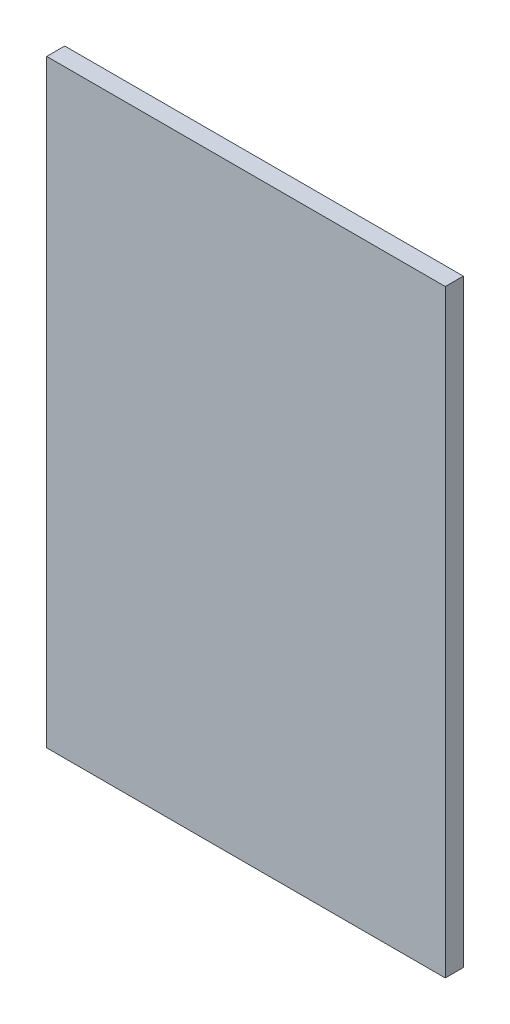
ISO-10303-21;
HEADER;
FILE_DESCRIPTION(('STEP AP214'),'2;1');
FILE_NAME('part.step','',(''),(''),'','','');
FILE_SCHEMA(('AUTOMOTIVE_DESIGN { 1 0 10303 214 1 1 1 1 }'));
ENDSEC;
DATA;
#1=APPLICATION_CONTEXT('core data for automotive mechanical design processes');
#2=APPLICATION_PROTOCOL_DEFINITION('international standard','automotive_design',2000,#1);
#3=PRODUCT_CONTEXT('',#1,'mechanical');
#4=PRODUCT('Part','Part','',(#3));
#5=PRODUCT_RELATED_PRODUCT_CATEGORY('part','',(#4));
#6=PRODUCT_DEFINITION_FORMATION('','',#4);
#7=PRODUCT_DEFINITION_CONTEXT('part definition',#1,'design');
#8=PRODUCT_DEFINITION('design','',#6,#7);
#9=PRODUCT_DEFINITION_SHAPE('','',#8);
#10=(LENGTH_UNIT() NAMED_UNIT(*) SI_UNIT(.MILLI.,.METRE.));
#11=(NAMED_UNIT(*) PLANE_ANGLE_UNIT() SI_UNIT($,.RADIAN.));
#12=(NAMED_UNIT(*) SI_UNIT($,.STERADIAN.) SOLID_ANGLE_UNIT());
#13=UNCERTAINTY_MEASURE_WITH_UNIT(LENGTH_MEASURE(1.E-05),#10,'distance_accuracy_value','');
#14=(GEOMETRIC_REPRESENTATION_CONTEXT(3) GLOBAL_UNCERTAINTY_ASSIGNED_CONTEXT((#13)) GLOBAL_UNIT_ASSIGNED_CONTEXT((#10,
#11,#12)) REPRESENTATION_CONTEXT('',''));
#15=CARTESIAN_POINT('',(0.,0.,0.));
#16=DIRECTION('',(0.,0.,1.));
#17=DIRECTION('',(1.,0.,0.));
#18=AXIS2_PLACEMENT_3D('',#15,#16,#17);
#19=CARTESIAN_POINT('',(-199.,-299.,18.));
#20=DIRECTION('',(1.,0.,0.));
#21=DIRECTION('',(0.,0.,-1.));
#22=AXIS2_PLACEMENT_3D('',#19,#20,#21);
#23=PLANE('',#22);
#24=DIRECTION('',(0.,-1.,0.));
#25=VECTOR('',#24,1.);
#26=CARTESIAN_POINT('',(-199.,-299.,0.));
#27=LINE('',#26,#25);
#28=CARTESIAN_POINT('',(-199.,299.,0.));
#29=VERTEX_POINT('',#28);
#30=CARTESIAN_POINT('',(-199.,-299.,0.));
#31=VERTEX_POINT('',#30);
#32=EDGE_CURVE('E95',#29,#31,#27,.T.);
#33=ORIENTED_EDGE('',*,*,#32,.T.);
#34=DIRECTION('',(0.,0.,-1.));
#35=VECTOR('',#34,1.);
#36=CARTESIAN_POINT('',(-199.,-299.,18.));
#37=LINE('',#36,#35);
#38=CARTESIAN_POINT('',(-199.,-299.,18.));
#39=VERTEX_POINT('',#38);
#40=EDGE_CURVE('E11',#39,#31,#37,.T.);
#41=ORIENTED_EDGE('',*,*,#40,.F.);
#42=DIRECTION('',(0.,-1.,0.));
#43=VECTOR('',#42,1.);
#44=CARTESIAN_POINT('',(-199.,-299.,18.));
#45=LINE('',#44,#43);
#46=CARTESIAN_POINT('',(-199.,299.,18.));
#47=VERTEX_POINT('',#46);
#48=EDGE_CURVE('E83',#47,#39,#45,.T.);
#49=ORIENTED_EDGE('',*,*,#48,.F.);
#50=DIRECTION('',(0.,0.,-1.));
#51=VECTOR('',#50,1.);
#52=CARTESIAN_POINT('',(-199.,299.,18.));
#53=LINE('',#52,#51);
#54=EDGE_CURVE('E91',#47,#29,#53,.T.);
#55=ORIENTED_EDGE('',*,*,#54,.T.);
#56=EDGE_LOOP('',(#33,#41,#49,#55));
#57=FACE_BOUND('',#56,.T.);
#58=ADVANCED_FACE('F32',(#57),#23,.F.);
#59=CARTESIAN_POINT('',(199.,-299.,18.));
#60=DIRECTION('',(0.,1.,0.));
#61=DIRECTION('',(0.,0.,1.));
#62=AXIS2_PLACEMENT_3D('',#59,#60,#61);
#63=PLANE('',#62);
#64=DIRECTION('',(1.,0.,0.));
#65=VECTOR('',#64,1.);
#66=CARTESIAN_POINT('',(199.,-299.,0.));
#67=LINE('',#66,#65);
#68=CARTESIAN_POINT('',(199.,-299.,0.));
#69=VERTEX_POINT('',#68);
#70=EDGE_CURVE('E87',#31,#69,#67,.T.);
#71=ORIENTED_EDGE('',*,*,#70,.T.);
#72=DIRECTION('',(0.,0.,-1.));
#73=VECTOR('',#72,1.);
#74=CARTESIAN_POINT('',(199.,-299.,18.));
#75=LINE('',#74,#73);
#76=CARTESIAN_POINT('',(199.,-299.,18.));
#77=VERTEX_POINT('',#76);
#78=EDGE_CURVE('E40',#77,#69,#75,.T.);
#79=ORIENTED_EDGE('',*,*,#78,.F.);
#80=DIRECTION('',(1.,0.,0.));
#81=VECTOR('',#80,1.);
#82=CARTESIAN_POINT('',(199.,-299.,18.));
#83=LINE('',#82,#81);
#84=EDGE_CURVE('E78',#39,#77,#83,.T.);
#85=ORIENTED_EDGE('',*,*,#84,.F.);
#86=ORIENTED_EDGE('',*,*,#40,.T.);
#87=EDGE_LOOP('',(#71,#79,#85,#86));
#88=FACE_BOUND('',#87,.T.);
#89=ADVANCED_FACE('F86',(#88),#63,.F.);
#90=CARTESIAN_POINT('',(199.,-299.,18.));
#91=DIRECTION('',(-1.,0.,0.));
#92=DIRECTION('',(0.,0.,1.));
#93=AXIS2_PLACEMENT_3D('',#90,#91,#92);
#94=PLANE('',#93);
#95=DIRECTION('',(0.,1.,0.));
#96=VECTOR('',#95,1.);
#97=CARTESIAN_POINT('',(199.,-299.,0.));
#98=LINE('',#97,#96);
#99=CARTESIAN_POINT('',(199.,299.,0.));
#100=VERTEX_POINT('',#99);
#101=EDGE_CURVE('E65',#69,#100,#98,.T.);
#102=ORIENTED_EDGE('',*,*,#101,.T.);
#103=DIRECTION('',(0.,0.,-1.));
#104=VECTOR('',#103,1.);
#105=CARTESIAN_POINT('',(199.,299.,18.));
#106=LINE('',#105,#104);
#107=CARTESIAN_POINT('',(199.,299.,18.));
#108=VERTEX_POINT('',#107);
#109=EDGE_CURVE('E88',#108,#100,#106,.T.);
#110=ORIENTED_EDGE('',*,*,#109,.F.);
#111=DIRECTION('',(0.,1.,0.));
#112=VECTOR('',#111,1.);
#113=CARTESIAN_POINT('',(199.,-299.,18.));
#114=LINE('',#113,#112);
#115=EDGE_CURVE('E81',#77,#108,#114,.T.);
#116=ORIENTED_EDGE('',*,*,#115,.F.);
#117=ORIENTED_EDGE('',*,*,#78,.T.);
#118=EDGE_LOOP('',(#102,#110,#116,#117));
#119=FACE_BOUND('',#118,.T.);
#120=ADVANCED_FACE('F89',(#119),#94,.F.);
#121=CARTESIAN_POINT('',(199.,299.,18.));
#122=DIRECTION('',(0.,-1.,0.));
#123=DIRECTION('',(0.,0.,-1.));
#124=AXIS2_PLACEMENT_3D('',#121,#122,#123);
#125=PLANE('',#124);
#126=DIRECTION('',(-1.,0.,0.));
#127=VECTOR('',#126,1.);
#128=CARTESIAN_POINT('',(199.,299.,0.));
#129=LINE('',#128,#127);
#130=EDGE_CURVE('E71',#100,#29,#129,.T.);
#131=ORIENTED_EDGE('',*,*,#130,.T.);
#132=ORIENTED_EDGE('',*,*,#54,.F.);
#133=DIRECTION('',(-1.,0.,0.));
#134=VECTOR('',#133,1.);
#135=CARTESIAN_POINT('',(199.,299.,18.));
#136=LINE('',#135,#134);
#137=EDGE_CURVE('E48',#108,#47,#136,.T.);
#138=ORIENTED_EDGE('',*,*,#137,.F.);
#139=ORIENTED_EDGE('',*,*,#109,.T.);
#140=EDGE_LOOP('',(#131,#132,#138,#139));
#141=FACE_BOUND('',#140,.T.);
#142=ADVANCED_FACE('F102',(#141),#125,.F.);
#143=CARTESIAN_POINT('',(0.,0.,18.));
#144=DIRECTION('',(0.,0.,1.));
#145=DIRECTION('',(1.,0.,0.));
#146=AXIS2_PLACEMENT_3D('',#143,#144,#145);
#147=PLANE('',#146);
#148=ORIENTED_EDGE('',*,*,#48,.T.);
#149=ORIENTED_EDGE('',*,*,#84,.T.);
#150=ORIENTED_EDGE('',*,*,#115,.T.);
#151=ORIENTED_EDGE('',*,*,#137,.T.);
#152=EDGE_LOOP('',(#148,#149,#150,#151));
#153=FACE_BOUND('',#152,.T.);
#154=ADVANCED_FACE('F79',(#153),#147,.T.);
#155=CARTESIAN_POINT('',(0.,0.,0.));
#156=DIRECTION('',(0.,0.,1.));
#157=DIRECTION('',(1.,0.,0.));
#158=AXIS2_PLACEMENT_3D('',#155,#156,#157);
#159=PLANE('',#158);
#160=ORIENTED_EDGE('',*,*,#32,.F.);
#161=ORIENTED_EDGE('',*,*,#130,.F.);
#162=ORIENTED_EDGE('',*,*,#101,.F.);
#163=ORIENTED_EDGE('',*,*,#70,.F.);
#164=EDGE_LOOP('',(#160,#161,#162,#163));
#165=FACE_BOUND('',#164,.T.);
#166=ADVANCED_FACE('F105',(#165),#159,.F.);
#167=CLOSED_SHELL('',(#58,#89,#120,#142,#154,#166));
#168=MANIFOLD_SOLID_BREP('B2',#167);
#169=ADVANCED_BREP_SHAPE_REPRESENTATION('',(#18,#168),#14);
#170=SHAPE_DEFINITION_REPRESENTATION(#9,#169);
ENDSEC;
END-ISO-10303-21;
